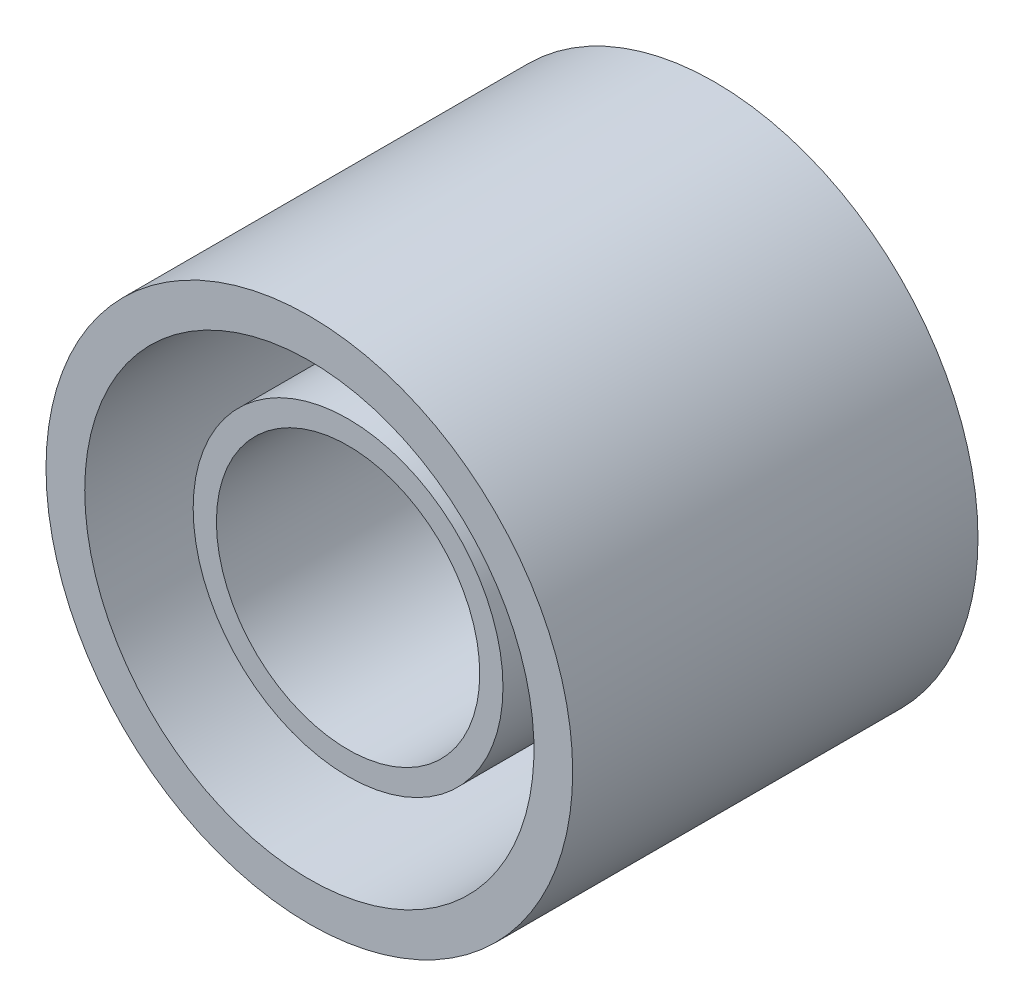
ISO-10303-21;
HEADER;
FILE_DESCRIPTION(('STEP AP214'),'2;1');
FILE_NAME('part.step','',(''),(''),'','','');
FILE_SCHEMA(('AUTOMOTIVE_DESIGN { 1 0 10303 214 1 1 1 1 }'));
ENDSEC;
DATA;
#1=APPLICATION_CONTEXT('core data for automotive mechanical design processes');
#2=APPLICATION_PROTOCOL_DEFINITION('international standard','automotive_design',2000,#1);
#3=PRODUCT_CONTEXT('',#1,'mechanical');
#4=PRODUCT('Part','Part','',(#3));
#5=PRODUCT_RELATED_PRODUCT_CATEGORY('part','',(#4));
#6=PRODUCT_DEFINITION_FORMATION('','',#4);
#7=PRODUCT_DEFINITION_CONTEXT('part definition',#1,'design');
#8=PRODUCT_DEFINITION('design','',#6,#7);
#9=PRODUCT_DEFINITION_SHAPE('','',#8);
#10=(LENGTH_UNIT() NAMED_UNIT(*) SI_UNIT(.MILLI.,.METRE.));
#11=(NAMED_UNIT(*) PLANE_ANGLE_UNIT() SI_UNIT($,.RADIAN.));
#12=(NAMED_UNIT(*) SI_UNIT($,.STERADIAN.) SOLID_ANGLE_UNIT());
#13=UNCERTAINTY_MEASURE_WITH_UNIT(LENGTH_MEASURE(1.E-05),#10,'distance_accuracy_value','');
#14=(GEOMETRIC_REPRESENTATION_CONTEXT(3) GLOBAL_UNCERTAINTY_ASSIGNED_CONTEXT((#13)) GLOBAL_UNIT_ASSIGNED_CONTEXT((#10,
#11,#12)) REPRESENTATION_CONTEXT('',''));
#15=CARTESIAN_POINT('',(0.,0.,0.));
#16=DIRECTION('',(0.,0.,1.));
#17=DIRECTION('',(1.,0.,0.));
#18=AXIS2_PLACEMENT_3D('',#15,#16,#17);
#19=CARTESIAN_POINT('',(259.301545348096,-114.573704322228,0.));
#20=DIRECTION('',(0.,0.,1.));
#21=DIRECTION('',(1.,0.,0.));
#22=AXIS2_PLACEMENT_3D('',#19,#20,#21);
#23=PLANE('',#22);
#24=CARTESIAN_POINT('',(259.301545348096,-148.573704322228,0.));
#25=DIRECTION('',(0.,0.,-1.));
#26=DIRECTION('',(-1.,0.,0.));
#27=AXIS2_PLACEMENT_3D('',#24,#25,#26);
#28=CIRCLE('',#27,15.0000000000005);
#29=CARTESIAN_POINT('',(244.301545348095,-148.573704322228,0.));
#30=VERTEX_POINT('',#29);
#31=EDGE_CURVE('E10',#30,#30,#28,.T.);
#32=ORIENTED_EDGE('',*,*,#31,.F.);
#33=EDGE_LOOP('',(#32));
#34=FACE_BOUND('',#33,.T.);
#35=CARTESIAN_POINT('',(259.301545348096,-148.573704322228,0.));
#36=DIRECTION('',(0.,0.,-1.));
#37=DIRECTION('',(-1.,0.,0.));
#38=AXIS2_PLACEMENT_3D('',#35,#36,#37);
#39=CIRCLE('',#38,34.);
#40=CARTESIAN_POINT('',(225.301545348096,-148.573704322228,0.));
#41=VERTEX_POINT('',#40);
#42=EDGE_CURVE('E65',#41,#41,#39,.T.);
#43=ORIENTED_EDGE('',*,*,#42,.T.);
#44=EDGE_LOOP('',(#43));
#45=FACE_BOUND('',#44,.T.);
#46=ADVANCED_FACE('F31',(#34,#45),#23,.F.);
#47=CARTESIAN_POINT('',(259.301545348096,-148.573704322228,-1.12000000000004));
#48=DIRECTION('',(0.,0.,-1.));
#49=DIRECTION('',(-1.,0.,0.));
#50=AXIS2_PLACEMENT_3D('',#47,#48,#49);
#51=CYLINDRICAL_SURFACE('',#50,15.0000000000005);
#52=CARTESIAN_POINT('',(259.301545348096,-148.573704322228,5.));
#53=DIRECTION('',(0.,0.,-1.));
#54=DIRECTION('',(-1.,0.,0.));
#55=AXIS2_PLACEMENT_3D('',#52,#53,#54);
#56=CIRCLE('',#55,15.0000000000005);
#57=CARTESIAN_POINT('',(244.301545348095,-148.573704322228,5.));
#58=VERTEX_POINT('',#57);
#59=EDGE_CURVE('E37',#58,#58,#56,.T.);
#60=ORIENTED_EDGE('',*,*,#59,.F.);
#61=EDGE_LOOP('',(#60));
#62=FACE_BOUND('',#61,.T.);
#63=ORIENTED_EDGE('',*,*,#31,.T.);
#64=EDGE_LOOP('',(#63));
#65=FACE_BOUND('',#64,.T.);
#66=ADVANCED_FACE('F114',(#62,#65),#51,.F.);
#67=CARTESIAN_POINT('',(259.301545348096,-133.573704322227,5.));
#68=DIRECTION('',(0.,0.,-1.));
#69=DIRECTION('',(-1.,0.,0.));
#70=AXIS2_PLACEMENT_3D('',#67,#68,#69);
#71=PLANE('',#70);
#72=CARTESIAN_POINT('',(259.301545348096,-148.573704322228,5.));
#73=DIRECTION('',(0.,0.,-1.));
#74=DIRECTION('',(-1.,0.,0.));
#75=AXIS2_PLACEMENT_3D('',#72,#73,#74);
#76=CIRCLE('',#75,17.);
#77=CARTESIAN_POINT('',(242.301545348096,-148.573704322228,5.));
#78=VERTEX_POINT('',#77);
#79=EDGE_CURVE('E41',#78,#78,#76,.T.);
#80=ORIENTED_EDGE('',*,*,#79,.F.);
#81=EDGE_LOOP('',(#80));
#82=FACE_BOUND('',#81,.T.);
#83=ORIENTED_EDGE('',*,*,#59,.T.);
#84=EDGE_LOOP('',(#83));
#85=FACE_BOUND('',#84,.T.);
#86=ADVANCED_FACE('F109',(#82,#85),#71,.F.);
#87=CARTESIAN_POINT('',(259.301545348096,-148.573704322228,-1.12000000000004));
#88=DIRECTION('',(0.,0.,-1.));
#89=DIRECTION('',(-1.,0.,0.));
#90=AXIS2_PLACEMENT_3D('',#87,#88,#89);
#91=CYLINDRICAL_SURFACE('',#90,17.);
#92=CARTESIAN_POINT('',(259.301545348096,-148.573704322228,47.330517131389));
#93=DIRECTION('',(0.,0.,-1.));
#94=DIRECTION('',(-1.,0.,0.));
#95=AXIS2_PLACEMENT_3D('',#92,#93,#94);
#96=CIRCLE('',#95,17.);
#97=CARTESIAN_POINT('',(242.301545348096,-148.573704322228,47.330517131389));
#98=VERTEX_POINT('',#97);
#99=EDGE_CURVE('E45',#98,#98,#96,.T.);
#100=ORIENTED_EDGE('',*,*,#99,.F.);
#101=EDGE_LOOP('',(#100));
#102=FACE_BOUND('',#101,.T.);
#103=ORIENTED_EDGE('',*,*,#79,.T.);
#104=EDGE_LOOP('',(#103));
#105=FACE_BOUND('',#104,.T.);
#106=ADVANCED_FACE('F103',(#102,#105),#91,.F.);
#107=CARTESIAN_POINT('',(259.301545348096,-128.573704322228,47.330517131389));
#108=DIRECTION('',(0.,0.,-1.));
#109=DIRECTION('',(-1.,0.,0.));
#110=AXIS2_PLACEMENT_3D('',#107,#108,#109);
#111=PLANE('',#110);
#112=CARTESIAN_POINT('',(259.301545348096,-148.573704322228,47.330517131389));
#113=DIRECTION('',(0.,0.,-1.));
#114=DIRECTION('',(-1.,0.,0.));
#115=AXIS2_PLACEMENT_3D('',#112,#113,#114);
#116=CIRCLE('',#115,20.);
#117=CARTESIAN_POINT('',(239.301545348096,-148.573704322228,47.330517131389));
#118=VERTEX_POINT('',#117);
#119=EDGE_CURVE('E50',#118,#118,#116,.T.);
#120=ORIENTED_EDGE('',*,*,#119,.F.);
#121=EDGE_LOOP('',(#120));
#122=FACE_BOUND('',#121,.T.);
#123=ORIENTED_EDGE('',*,*,#99,.T.);
#124=EDGE_LOOP('',(#123));
#125=FACE_BOUND('',#124,.T.);
#126=ADVANCED_FACE('F97',(#122,#125),#111,.F.);
#127=CARTESIAN_POINT('',(259.301545348096,-148.573704322228,-1.12000000000004));
#128=DIRECTION('',(0.,0.,-1.));
#129=DIRECTION('',(-1.,0.,0.));
#130=AXIS2_PLACEMENT_3D('',#127,#128,#129);
#131=CYLINDRICAL_SURFACE('',#130,20.);
#132=CARTESIAN_POINT('',(259.301545348096,-148.573704322228,5.));
#133=DIRECTION('',(0.,0.,-1.));
#134=DIRECTION('',(-1.,0.,0.));
#135=AXIS2_PLACEMENT_3D('',#132,#133,#134);
#136=CIRCLE('',#135,20.);
#137=CARTESIAN_POINT('',(239.301545348096,-148.573704322228,5.));
#138=VERTEX_POINT('',#137);
#139=EDGE_CURVE('E53',#138,#138,#136,.T.);
#140=ORIENTED_EDGE('',*,*,#139,.F.);
#141=EDGE_LOOP('',(#140));
#142=FACE_BOUND('',#141,.T.);
#143=ORIENTED_EDGE('',*,*,#119,.T.);
#144=EDGE_LOOP('',(#143));
#145=FACE_BOUND('',#144,.T.);
#146=ADVANCED_FACE('F91',(#142,#145),#131,.T.);
#147=CARTESIAN_POINT('',(259.301545348096,-128.573704322228,5.));
#148=DIRECTION('',(0.,0.,-1.));
#149=DIRECTION('',(-1.,0.,0.));
#150=AXIS2_PLACEMENT_3D('',#147,#148,#149);
#151=PLANE('',#150);
#152=CARTESIAN_POINT('',(259.301545348096,-148.573704322228,5.));
#153=DIRECTION('',(0.,0.,-1.));
#154=DIRECTION('',(-1.,0.,0.));
#155=AXIS2_PLACEMENT_3D('',#152,#153,#154);
#156=CIRCLE('',#155,29.);
#157=CARTESIAN_POINT('',(230.301545348096,-148.573704322228,5.));
#158=VERTEX_POINT('',#157);
#159=EDGE_CURVE('E56',#158,#158,#156,.T.);
#160=ORIENTED_EDGE('',*,*,#159,.F.);
#161=EDGE_LOOP('',(#160));
#162=FACE_BOUND('',#161,.T.);
#163=ORIENTED_EDGE('',*,*,#139,.T.);
#164=EDGE_LOOP('',(#163));
#165=FACE_BOUND('',#164,.T.);
#166=ADVANCED_FACE('F85',(#162,#165),#151,.F.);
#167=CARTESIAN_POINT('',(259.301545348096,-148.573704322228,-1.12000000000004));
#168=DIRECTION('',(0.,0.,-1.));
#169=DIRECTION('',(-1.,0.,0.));
#170=AXIS2_PLACEMENT_3D('',#167,#168,#169);
#171=CYLINDRICAL_SURFACE('',#170,29.);
#172=CARTESIAN_POINT('',(259.301545348096,-148.573704322228,52.330517131389));
#173=DIRECTION('',(0.,0.,-1.));
#174=DIRECTION('',(-1.,0.,0.));
#175=AXIS2_PLACEMENT_3D('',#172,#173,#174);
#176=CIRCLE('',#175,29.);
#177=CARTESIAN_POINT('',(230.301545348096,-148.573704322228,52.330517131389));
#178=VERTEX_POINT('',#177);
#179=EDGE_CURVE('E59',#178,#178,#176,.T.);
#180=ORIENTED_EDGE('',*,*,#179,.F.);
#181=EDGE_LOOP('',(#180));
#182=FACE_BOUND('',#181,.T.);
#183=ORIENTED_EDGE('',*,*,#159,.T.);
#184=EDGE_LOOP('',(#183));
#185=FACE_BOUND('',#184,.T.);
#186=ADVANCED_FACE('F79',(#182,#185),#171,.F.);
#187=CARTESIAN_POINT('',(259.301545348096,-119.573704322228,52.330517131389));
#188=DIRECTION('',(0.,0.,-1.));
#189=DIRECTION('',(-1.,0.,0.));
#190=AXIS2_PLACEMENT_3D('',#187,#188,#189);
#191=PLANE('',#190);
#192=CARTESIAN_POINT('',(259.301545348096,-148.573704322228,52.330517131389));
#193=DIRECTION('',(0.,0.,-1.));
#194=DIRECTION('',(-1.,0.,0.));
#195=AXIS2_PLACEMENT_3D('',#192,#193,#194);
#196=CIRCLE('',#195,34.);
#197=CARTESIAN_POINT('',(225.301545348096,-148.573704322228,52.330517131389));
#198=VERTEX_POINT('',#197);
#199=EDGE_CURVE('E62',#198,#198,#196,.T.);
#200=ORIENTED_EDGE('',*,*,#199,.F.);
#201=EDGE_LOOP('',(#200));
#202=FACE_BOUND('',#201,.T.);
#203=ORIENTED_EDGE('',*,*,#179,.T.);
#204=EDGE_LOOP('',(#203));
#205=FACE_BOUND('',#204,.T.);
#206=ADVANCED_FACE('F73',(#202,#205),#191,.F.);
#207=CARTESIAN_POINT('',(259.301545348096,-148.573704322228,-1.12000000000004));
#208=DIRECTION('',(0.,0.,-1.));
#209=DIRECTION('',(-1.,0.,0.));
#210=AXIS2_PLACEMENT_3D('',#207,#208,#209);
#211=CYLINDRICAL_SURFACE('',#210,34.);
#212=ORIENTED_EDGE('',*,*,#42,.F.);
#213=EDGE_LOOP('',(#212));
#214=FACE_BOUND('',#213,.T.);
#215=ORIENTED_EDGE('',*,*,#199,.T.);
#216=EDGE_LOOP('',(#215));
#217=FACE_BOUND('',#216,.T.);
#218=ADVANCED_FACE('F70',(#214,#217),#211,.T.);
#219=CLOSED_SHELL('',(#46,#66,#86,#106,#126,#146,#166,#186,#206,#218));
#220=MANIFOLD_SOLID_BREP('B2',#219);
#221=ADVANCED_BREP_SHAPE_REPRESENTATION('',(#18,#220),#14);
#222=SHAPE_DEFINITION_REPRESENTATION(#9,#221);
ENDSEC;
END-ISO-10303-21;
